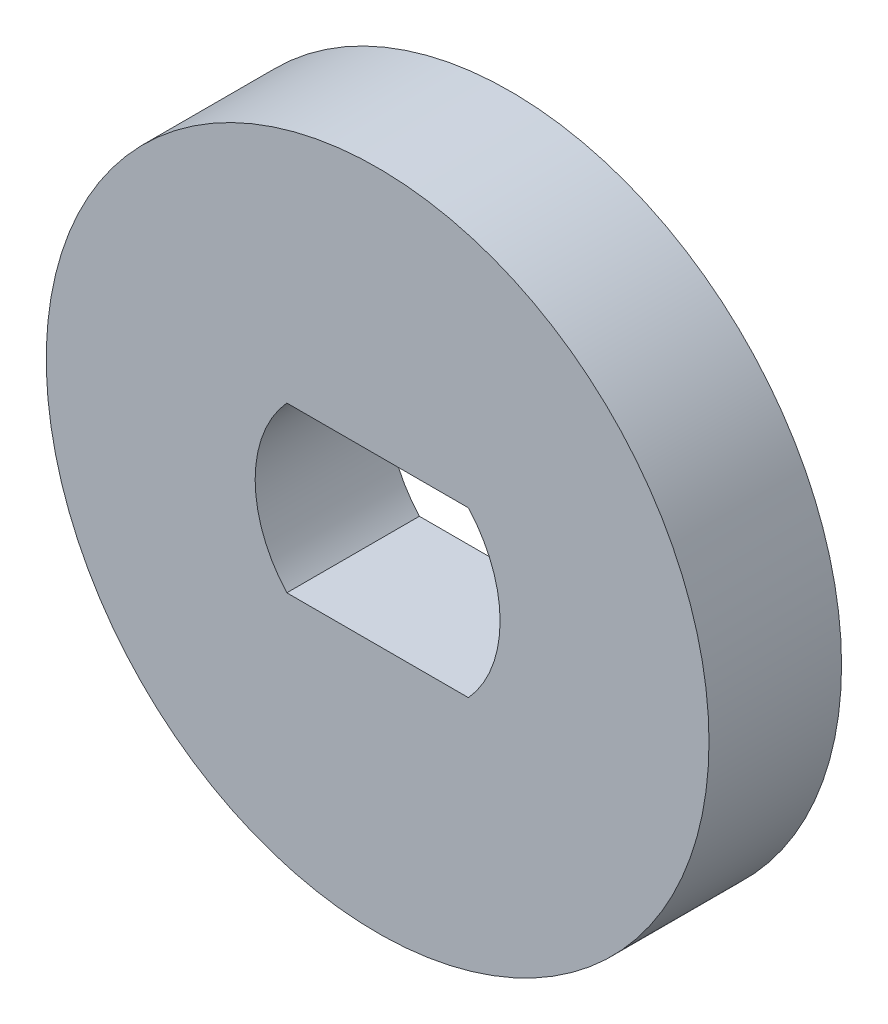
ISO-10303-21;
HEADER;
FILE_DESCRIPTION(('STEP AP214'),'2;1');
FILE_NAME('part.step','',(''),(''),'','','');
FILE_SCHEMA(('AUTOMOTIVE_DESIGN { 1 0 10303 214 1 1 1 1 }'));
ENDSEC;
DATA;
#1=APPLICATION_CONTEXT('core data for automotive mechanical design processes');
#2=APPLICATION_PROTOCOL_DEFINITION('international standard','automotive_design',2000,#1);
#3=PRODUCT_CONTEXT('',#1,'mechanical');
#4=PRODUCT('Part','Part','',(#3));
#5=PRODUCT_RELATED_PRODUCT_CATEGORY('part','',(#4));
#6=PRODUCT_DEFINITION_FORMATION('','',#4);
#7=PRODUCT_DEFINITION_CONTEXT('part definition',#1,'design');
#8=PRODUCT_DEFINITION('design','',#6,#7);
#9=PRODUCT_DEFINITION_SHAPE('','',#8);
#10=(LENGTH_UNIT() NAMED_UNIT(*) SI_UNIT(.MILLI.,.METRE.));
#11=(NAMED_UNIT(*) PLANE_ANGLE_UNIT() SI_UNIT($,.RADIAN.));
#12=(NAMED_UNIT(*) SI_UNIT($,.STERADIAN.) SOLID_ANGLE_UNIT());
#13=UNCERTAINTY_MEASURE_WITH_UNIT(LENGTH_MEASURE(1.E-05),#10,'distance_accuracy_value','');
#14=(GEOMETRIC_REPRESENTATION_CONTEXT(3) GLOBAL_UNCERTAINTY_ASSIGNED_CONTEXT((#13)) GLOBAL_UNIT_ASSIGNED_CONTEXT((#10,
#11,#12)) REPRESENTATION_CONTEXT('',''));
#15=CARTESIAN_POINT('',(0.,0.,0.));
#16=DIRECTION('',(0.,0.,1.));
#17=DIRECTION('',(1.,0.,0.));
#18=AXIS2_PLACEMENT_3D('',#15,#16,#17);
#19=CARTESIAN_POINT('',(0.,0.,3.175));
#20=DIRECTION('',(0.,0.,-1.));
#21=DIRECTION('',(-1.,0.,0.));
#22=AXIS2_PLACEMENT_3D('',#19,#20,#21);
#23=CYLINDRICAL_SURFACE('',#22,2.9337);
#24=CARTESIAN_POINT('',(0.,0.,0.));
#25=DIRECTION('',(0.,0.,1.));
#26=DIRECTION('',(1.,0.,0.));
#27=AXIS2_PLACEMENT_3D('',#24,#25,#26);
#28=CIRCLE('',#27,2.9337);
#29=CARTESIAN_POINT('',(-2.17522491710627,1.9685,0.));
#30=VERTEX_POINT('',#29);
#31=CARTESIAN_POINT('',(-2.17522491710627,-1.9685,0.));
#32=VERTEX_POINT('',#31);
#33=EDGE_CURVE('E102',#30,#32,#28,.T.);
#34=ORIENTED_EDGE('',*,*,#33,.F.);
#35=DIRECTION('',(0.,0.,-1.));
#36=VECTOR('',#35,1.);
#37=CARTESIAN_POINT('',(-2.17522491710627,1.9685,3.175));
#38=LINE('',#37,#36);
#39=CARTESIAN_POINT('',(-2.17522491710627,1.9685,3.175));
#40=VERTEX_POINT('',#39);
#41=EDGE_CURVE('E11',#40,#30,#38,.T.);
#42=ORIENTED_EDGE('',*,*,#41,.F.);
#43=CARTESIAN_POINT('',(0.,0.,3.175));
#44=DIRECTION('',(0.,0.,1.));
#45=DIRECTION('',(1.,0.,0.));
#46=AXIS2_PLACEMENT_3D('',#43,#44,#45);
#47=CIRCLE('',#46,2.9337);
#48=CARTESIAN_POINT('',(-2.17522491710627,-1.9685,3.175));
#49=VERTEX_POINT('',#48);
#50=EDGE_CURVE('E84',#40,#49,#47,.T.);
#51=ORIENTED_EDGE('',*,*,#50,.T.);
#52=DIRECTION('',(0.,0.,-1.));
#53=VECTOR('',#52,1.);
#54=CARTESIAN_POINT('',(-2.17522491710627,-1.9685,3.175));
#55=LINE('',#54,#53);
#56=EDGE_CURVE('E51',#49,#32,#55,.T.);
#57=ORIENTED_EDGE('',*,*,#56,.T.);
#58=EDGE_LOOP('',(#34,#42,#51,#57));
#59=FACE_BOUND('',#58,.T.);
#60=ADVANCED_FACE('F35',(#59),#23,.F.);
#61=CARTESIAN_POINT('',(0.,1.9685,3.175));
#62=DIRECTION('',(0.,1.,0.));
#63=DIRECTION('',(0.,0.,1.));
#64=AXIS2_PLACEMENT_3D('',#61,#62,#63);
#65=PLANE('',#64);
#66=DIRECTION('',(1.,0.,0.));
#67=VECTOR('',#66,1.);
#68=CARTESIAN_POINT('',(0.,1.9685,0.));
#69=LINE('',#68,#67);
#70=CARTESIAN_POINT('',(2.17522491710627,1.9685,0.));
#71=VERTEX_POINT('',#70);
#72=EDGE_CURVE('E90',#30,#71,#69,.T.);
#73=ORIENTED_EDGE('',*,*,#72,.T.);
#74=DIRECTION('',(0.,0.,-1.));
#75=VECTOR('',#74,1.);
#76=CARTESIAN_POINT('',(2.17522491710627,1.9685,3.175));
#77=LINE('',#76,#75);
#78=CARTESIAN_POINT('',(2.17522491710627,1.9685,3.175));
#79=VERTEX_POINT('',#78);
#80=EDGE_CURVE('E43',#79,#71,#77,.T.);
#81=ORIENTED_EDGE('',*,*,#80,.F.);
#82=DIRECTION('',(1.,0.,0.));
#83=VECTOR('',#82,1.);
#84=CARTESIAN_POINT('',(0.,1.9685,3.175));
#85=LINE('',#84,#83);
#86=EDGE_CURVE('E77',#40,#79,#85,.T.);
#87=ORIENTED_EDGE('',*,*,#86,.F.);
#88=ORIENTED_EDGE('',*,*,#41,.T.);
#89=EDGE_LOOP('',(#73,#81,#87,#88));
#90=FACE_BOUND('',#89,.T.);
#91=ADVANCED_FACE('F88',(#90),#65,.F.);
#92=CARTESIAN_POINT('',(0.,0.,3.175));
#93=DIRECTION('',(0.,0.,-1.));
#94=DIRECTION('',(-1.,0.,0.));
#95=AXIS2_PLACEMENT_3D('',#92,#93,#94);
#96=CYLINDRICAL_SURFACE('',#95,2.9337);
#97=CARTESIAN_POINT('',(0.,0.,0.));
#98=DIRECTION('',(0.,0.,1.));
#99=DIRECTION('',(1.,0.,0.));
#100=AXIS2_PLACEMENT_3D('',#97,#98,#99);
#101=CIRCLE('',#100,2.9337);
#102=CARTESIAN_POINT('',(2.17522491710627,-1.9685,0.));
#103=VERTEX_POINT('',#102);
#104=EDGE_CURVE('E105',#103,#71,#101,.T.);
#105=ORIENTED_EDGE('',*,*,#104,.F.);
#106=DIRECTION('',(0.,0.,-1.));
#107=VECTOR('',#106,1.);
#108=CARTESIAN_POINT('',(2.17522491710627,-1.9685,3.175));
#109=LINE('',#108,#107);
#110=CARTESIAN_POINT('',(2.17522491710627,-1.9685,3.175));
#111=VERTEX_POINT('',#110);
#112=EDGE_CURVE('E64',#111,#103,#109,.T.);
#113=ORIENTED_EDGE('',*,*,#112,.F.);
#114=CARTESIAN_POINT('',(0.,0.,3.175));
#115=DIRECTION('',(0.,0.,1.));
#116=DIRECTION('',(1.,0.,0.));
#117=AXIS2_PLACEMENT_3D('',#114,#115,#116);
#118=CIRCLE('',#117,2.9337);
#119=EDGE_CURVE('E83',#111,#79,#118,.T.);
#120=ORIENTED_EDGE('',*,*,#119,.T.);
#121=ORIENTED_EDGE('',*,*,#80,.T.);
#122=EDGE_LOOP('',(#105,#113,#120,#121));
#123=FACE_BOUND('',#122,.T.);
#124=ADVANCED_FACE('F93',(#123),#96,.F.);
#125=CARTESIAN_POINT('',(0.,-1.9685,3.175));
#126=DIRECTION('',(0.,1.,0.));
#127=DIRECTION('',(0.,0.,1.));
#128=AXIS2_PLACEMENT_3D('',#125,#126,#127);
#129=PLANE('',#128);
#130=DIRECTION('',(1.,0.,0.));
#131=VECTOR('',#130,1.);
#132=CARTESIAN_POINT('',(0.,-1.9685,0.));
#133=LINE('',#132,#131);
#134=EDGE_CURVE('E107',#32,#103,#133,.T.);
#135=ORIENTED_EDGE('',*,*,#134,.F.);
#136=ORIENTED_EDGE('',*,*,#56,.F.);
#137=DIRECTION('',(1.,0.,0.));
#138=VECTOR('',#137,1.);
#139=CARTESIAN_POINT('',(0.,-1.9685,3.175));
#140=LINE('',#139,#138);
#141=EDGE_CURVE('E94',#49,#111,#140,.T.);
#142=ORIENTED_EDGE('',*,*,#141,.T.);
#143=ORIENTED_EDGE('',*,*,#112,.T.);
#144=EDGE_LOOP('',(#135,#136,#142,#143));
#145=FACE_BOUND('',#144,.T.);
#146=ADVANCED_FACE('F116',(#145),#129,.T.);
#147=CARTESIAN_POINT('',(0.,0.,3.175));
#148=DIRECTION('',(0.,0.,-1.));
#149=DIRECTION('',(-1.,0.,0.));
#150=AXIS2_PLACEMENT_3D('',#147,#148,#149);
#151=CYLINDRICAL_SURFACE('',#150,7.9375);
#152=CARTESIAN_POINT('',(0.,0.,3.175));
#153=DIRECTION('',(0.,0.,1.));
#154=DIRECTION('',(1.,0.,0.));
#155=AXIS2_PLACEMENT_3D('',#152,#153,#154);
#156=CIRCLE('',#155,7.9375);
#157=CARTESIAN_POINT('',(7.9375,0.,3.175));
#158=VERTEX_POINT('',#157);
#159=EDGE_CURVE('E96',#158,#158,#156,.T.);
#160=ORIENTED_EDGE('',*,*,#159,.F.);
#161=EDGE_LOOP('',(#160));
#162=FACE_BOUND('',#161,.T.);
#163=CARTESIAN_POINT('',(0.,0.,0.));
#164=DIRECTION('',(0.,0.,1.));
#165=DIRECTION('',(1.,0.,0.));
#166=AXIS2_PLACEMENT_3D('',#163,#164,#165);
#167=CIRCLE('',#166,7.9375);
#168=CARTESIAN_POINT('',(7.9375,0.,0.));
#169=VERTEX_POINT('',#168);
#170=EDGE_CURVE('E110',#169,#169,#167,.T.);
#171=ORIENTED_EDGE('',*,*,#170,.T.);
#172=EDGE_LOOP('',(#171));
#173=FACE_BOUND('',#172,.T.);
#174=ADVANCED_FACE('F118',(#162,#173),#151,.T.);
#175=CARTESIAN_POINT('',(0.,0.,3.175));
#176=DIRECTION('',(0.,0.,1.));
#177=DIRECTION('',(1.,0.,0.));
#178=AXIS2_PLACEMENT_3D('',#175,#176,#177);
#179=PLANE('',#178);
#180=ORIENTED_EDGE('',*,*,#50,.F.);
#181=ORIENTED_EDGE('',*,*,#86,.T.);
#182=ORIENTED_EDGE('',*,*,#119,.F.);
#183=ORIENTED_EDGE('',*,*,#141,.F.);
#184=EDGE_LOOP('',(#180,#181,#182,#183));
#185=FACE_BOUND('',#184,.T.);
#186=ORIENTED_EDGE('',*,*,#159,.T.);
#187=EDGE_LOOP('',(#186));
#188=FACE_BOUND('',#187,.T.);
#189=ADVANCED_FACE('F79',(#185,#188),#179,.T.);
#190=CARTESIAN_POINT('',(0.,0.,0.));
#191=DIRECTION('',(0.,0.,1.));
#192=DIRECTION('',(1.,0.,0.));
#193=AXIS2_PLACEMENT_3D('',#190,#191,#192);
#194=PLANE('',#193);
#195=ORIENTED_EDGE('',*,*,#33,.T.);
#196=ORIENTED_EDGE('',*,*,#134,.T.);
#197=ORIENTED_EDGE('',*,*,#104,.T.);
#198=ORIENTED_EDGE('',*,*,#72,.F.);
#199=EDGE_LOOP('',(#195,#196,#197,#198));
#200=FACE_BOUND('',#199,.T.);
#201=ORIENTED_EDGE('',*,*,#170,.F.);
#202=EDGE_LOOP('',(#201));
#203=FACE_BOUND('',#202,.T.);
#204=ADVANCED_FACE('F156',(#200,#203),#194,.F.);
#205=CLOSED_SHELL('',(#60,#91,#124,#146,#174,#189,#204));
#206=MANIFOLD_SOLID_BREP('B2',#205);
#207=ADVANCED_BREP_SHAPE_REPRESENTATION('',(#18,#206),#14);
#208=SHAPE_DEFINITION_REPRESENTATION(#9,#207);
ENDSEC;
END-ISO-10303-21;
